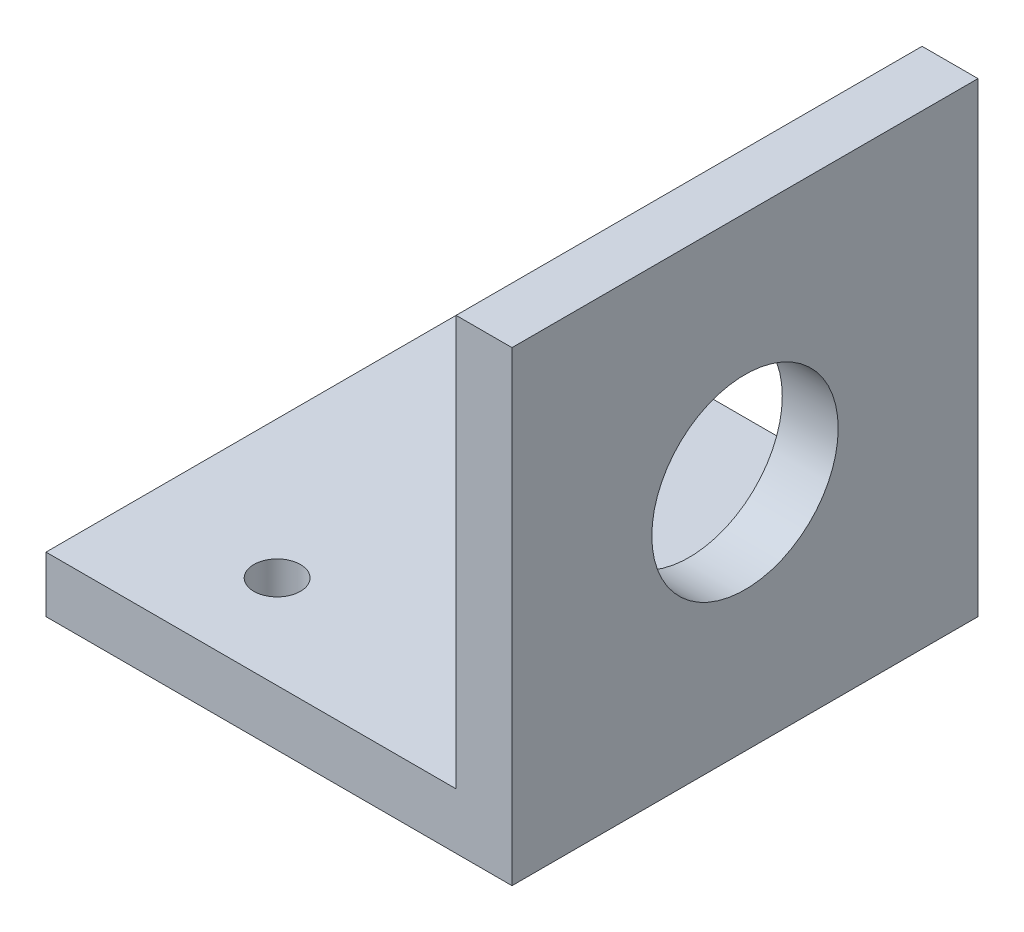
ISO-10303-21;
HEADER;
FILE_DESCRIPTION(('STEP AP214'),'2;1');
FILE_NAME('part.step','',(''),(''),'','','');
FILE_SCHEMA(('AUTOMOTIVE_DESIGN { 1 0 10303 214 1 1 1 1 }'));
ENDSEC;
DATA;
#1=APPLICATION_CONTEXT('core data for automotive mechanical design processes');
#2=APPLICATION_PROTOCOL_DEFINITION('international standard','automotive_design',2000,#1);
#3=PRODUCT_CONTEXT('',#1,'mechanical');
#4=PRODUCT('Part','Part','',(#3));
#5=PRODUCT_RELATED_PRODUCT_CATEGORY('part','',(#4));
#6=PRODUCT_DEFINITION_FORMATION('','',#4);
#7=PRODUCT_DEFINITION_CONTEXT('part definition',#1,'design');
#8=PRODUCT_DEFINITION('design','',#6,#7);
#9=PRODUCT_DEFINITION_SHAPE('','',#8);
#10=(LENGTH_UNIT() NAMED_UNIT(*) SI_UNIT(.MILLI.,.METRE.));
#11=(NAMED_UNIT(*) PLANE_ANGLE_UNIT() SI_UNIT($,.RADIAN.));
#12=(NAMED_UNIT(*) SI_UNIT($,.STERADIAN.) SOLID_ANGLE_UNIT());
#13=UNCERTAINTY_MEASURE_WITH_UNIT(LENGTH_MEASURE(1.E-05),#10,'distance_accuracy_value','');
#14=(GEOMETRIC_REPRESENTATION_CONTEXT(3) GLOBAL_UNCERTAINTY_ASSIGNED_CONTEXT((#13)) GLOBAL_UNIT_ASSIGNED_CONTEXT((#10,
#11,#12)) REPRESENTATION_CONTEXT('',''));
#15=CARTESIAN_POINT('',(0.,0.,0.));
#16=DIRECTION('',(0.,0.,1.));
#17=DIRECTION('',(1.,0.,0.));
#18=AXIS2_PLACEMENT_3D('',#15,#16,#17);
#19=CARTESIAN_POINT('',(25.,6.,-25.));
#20=DIRECTION('',(-1.,0.,0.));
#21=DIRECTION('',(0.,0.,1.));
#22=AXIS2_PLACEMENT_3D('',#19,#20,#21);
#23=PLANE('',#22);
#24=CARTESIAN_POINT('',(25.,25.,0.));
#25=DIRECTION('',(1.,0.,0.));
#26=DIRECTION('',(0.,0.,-1.));
#27=AXIS2_PLACEMENT_3D('',#24,#25,#26);
#28=CIRCLE('',#27,10.);
#29=CARTESIAN_POINT('',(25.,25.,-9.99999999999999));
#30=VERTEX_POINT('',#29);
#31=EDGE_CURVE('E145',#30,#30,#28,.T.);
#32=ORIENTED_EDGE('',*,*,#31,.F.);
#33=EDGE_LOOP('',(#32));
#34=FACE_BOUND('',#33,.T.);
#35=DIRECTION('',(0.,0.,-1.));
#36=VECTOR('',#35,1.);
#37=CARTESIAN_POINT('',(25.,0.,-25.));
#38=LINE('',#37,#36);
#39=CARTESIAN_POINT('',(25.,0.,25.));
#40=VERTEX_POINT('',#39);
#41=CARTESIAN_POINT('',(25.,0.,-25.));
#42=VERTEX_POINT('',#41);
#43=EDGE_CURVE('E93',#40,#42,#38,.T.);
#44=ORIENTED_EDGE('',*,*,#43,.T.);
#45=DIRECTION('',(0.,-1.,0.));
#46=VECTOR('',#45,1.);
#47=CARTESIAN_POINT('',(25.,6.,-25.));
#48=LINE('',#47,#46);
#49=CARTESIAN_POINT('',(25.,50.,-25.));
#50=VERTEX_POINT('',#49);
#51=EDGE_CURVE('E11',#50,#42,#48,.T.);
#52=ORIENTED_EDGE('',*,*,#51,.F.);
#53=DIRECTION('',(0.,0.,-1.));
#54=VECTOR('',#53,1.);
#55=CARTESIAN_POINT('',(25.,50.,-25.));
#56=LINE('',#55,#54);
#57=CARTESIAN_POINT('',(25.,50.,25.));
#58=VERTEX_POINT('',#57);
#59=EDGE_CURVE('E95',#58,#50,#56,.T.);
#60=ORIENTED_EDGE('',*,*,#59,.F.);
#61=DIRECTION('',(0.,-1.,0.));
#62=VECTOR('',#61,1.);
#63=CARTESIAN_POINT('',(25.,6.,25.));
#64=LINE('',#63,#62);
#65=EDGE_CURVE('E79',#58,#40,#64,.T.);
#66=ORIENTED_EDGE('',*,*,#65,.T.);
#67=EDGE_LOOP('',(#44,#52,#60,#66));
#68=FACE_BOUND('',#67,.T.);
#69=ADVANCED_FACE('F33',(#34,#68),#23,.F.);
#70=CARTESIAN_POINT('',(-25.,6.,-25.));
#71=DIRECTION('',(0.,0.,1.));
#72=DIRECTION('',(1.,0.,0.));
#73=AXIS2_PLACEMENT_3D('',#70,#71,#72);
#74=PLANE('',#73);
#75=DIRECTION('',(-1.,0.,0.));
#76=VECTOR('',#75,1.);
#77=CARTESIAN_POINT('',(-25.,0.,-25.));
#78=LINE('',#77,#76);
#79=CARTESIAN_POINT('',(-25.,0.,-25.));
#80=VERTEX_POINT('',#79);
#81=EDGE_CURVE('E99',#42,#80,#78,.T.);
#82=ORIENTED_EDGE('',*,*,#81,.T.);
#83=DIRECTION('',(0.,-1.,0.));
#84=VECTOR('',#83,1.);
#85=CARTESIAN_POINT('',(-25.,6.,-25.));
#86=LINE('',#85,#84);
#87=CARTESIAN_POINT('',(-25.,6.,-25.));
#88=VERTEX_POINT('',#87);
#89=EDGE_CURVE('E41',#88,#80,#86,.T.);
#90=ORIENTED_EDGE('',*,*,#89,.F.);
#91=DIRECTION('',(-1.,0.,0.));
#92=VECTOR('',#91,1.);
#93=CARTESIAN_POINT('',(-25.,6.,-25.));
#94=LINE('',#93,#92);
#95=CARTESIAN_POINT('',(19.,6.,-25.));
#96=VERTEX_POINT('',#95);
#97=EDGE_CURVE('E86',#96,#88,#94,.T.);
#98=ORIENTED_EDGE('',*,*,#97,.F.);
#99=DIRECTION('',(0.,-1.,0.));
#100=VECTOR('',#99,1.);
#101=CARTESIAN_POINT('',(19.,50.,-25.));
#102=LINE('',#101,#100);
#103=CARTESIAN_POINT('',(19.,50.,-25.));
#104=VERTEX_POINT('',#103);
#105=EDGE_CURVE('E100',#104,#96,#102,.T.);
#106=ORIENTED_EDGE('',*,*,#105,.F.);
#107=DIRECTION('',(-1.,0.,0.));
#108=VECTOR('',#107,1.);
#109=CARTESIAN_POINT('',(19.,50.,-25.));
#110=LINE('',#109,#108);
#111=EDGE_CURVE('E139',#50,#104,#110,.T.);
#112=ORIENTED_EDGE('',*,*,#111,.F.);
#113=ORIENTED_EDGE('',*,*,#51,.T.);
#114=EDGE_LOOP('',(#82,#90,#98,#106,#112,#113));
#115=FACE_BOUND('',#114,.T.);
#116=ADVANCED_FACE('F183',(#115),#74,.F.);
#117=CARTESIAN_POINT('',(-25.,6.,-25.));
#118=DIRECTION('',(1.,0.,0.));
#119=DIRECTION('',(0.,0.,-1.));
#120=AXIS2_PLACEMENT_3D('',#117,#118,#119);
#121=PLANE('',#120);
#122=DIRECTION('',(0.,0.,1.));
#123=VECTOR('',#122,1.);
#124=CARTESIAN_POINT('',(-25.,0.,-25.));
#125=LINE('',#124,#123);
#126=CARTESIAN_POINT('',(-25.,0.,25.));
#127=VERTEX_POINT('',#126);
#128=EDGE_CURVE('E87',#80,#127,#125,.T.);
#129=ORIENTED_EDGE('',*,*,#128,.T.);
#130=DIRECTION('',(0.,-1.,0.));
#131=VECTOR('',#130,1.);
#132=CARTESIAN_POINT('',(-25.,6.,25.));
#133=LINE('',#132,#131);
#134=CARTESIAN_POINT('',(-25.,6.,25.));
#135=VERTEX_POINT('',#134);
#136=EDGE_CURVE('E82',#135,#127,#133,.T.);
#137=ORIENTED_EDGE('',*,*,#136,.F.);
#138=DIRECTION('',(0.,0.,1.));
#139=VECTOR('',#138,1.);
#140=CARTESIAN_POINT('',(-25.,6.,-25.));
#141=LINE('',#140,#139);
#142=EDGE_CURVE('E55',#88,#135,#141,.T.);
#143=ORIENTED_EDGE('',*,*,#142,.F.);
#144=ORIENTED_EDGE('',*,*,#89,.T.);
#145=EDGE_LOOP('',(#129,#137,#143,#144));
#146=FACE_BOUND('',#145,.T.);
#147=ADVANCED_FACE('F188',(#146),#121,.F.);
#148=CARTESIAN_POINT('',(-25.,6.,25.));
#149=DIRECTION('',(0.,0.,-1.));
#150=DIRECTION('',(-1.,0.,0.));
#151=AXIS2_PLACEMENT_3D('',#148,#149,#150);
#152=PLANE('',#151);
#153=DIRECTION('',(1.,0.,0.));
#154=VECTOR('',#153,1.);
#155=CARTESIAN_POINT('',(-25.,0.,25.));
#156=LINE('',#155,#154);
#157=EDGE_CURVE('E75',#127,#40,#156,.T.);
#158=ORIENTED_EDGE('',*,*,#157,.T.);
#159=ORIENTED_EDGE('',*,*,#65,.F.);
#160=DIRECTION('',(1.,0.,0.));
#161=VECTOR('',#160,1.);
#162=CARTESIAN_POINT('',(25.,50.,25.));
#163=LINE('',#162,#161);
#164=CARTESIAN_POINT('',(19.,50.,25.));
#165=VERTEX_POINT('',#164);
#166=EDGE_CURVE('E131',#165,#58,#163,.T.);
#167=ORIENTED_EDGE('',*,*,#166,.F.);
#168=DIRECTION('',(0.,-1.,0.));
#169=VECTOR('',#168,1.);
#170=CARTESIAN_POINT('',(19.,50.,25.));
#171=LINE('',#170,#169);
#172=CARTESIAN_POINT('',(19.,6.,25.));
#173=VERTEX_POINT('',#172);
#174=EDGE_CURVE('E104',#165,#173,#171,.T.);
#175=ORIENTED_EDGE('',*,*,#174,.T.);
#176=DIRECTION('',(1.,0.,0.));
#177=VECTOR('',#176,1.);
#178=CARTESIAN_POINT('',(-25.,6.,25.));
#179=LINE('',#178,#177);
#180=EDGE_CURVE('E96',#135,#173,#179,.T.);
#181=ORIENTED_EDGE('',*,*,#180,.F.);
#182=ORIENTED_EDGE('',*,*,#136,.T.);
#183=EDGE_LOOP('',(#158,#159,#167,#175,#181,#182));
#184=FACE_BOUND('',#183,.T.);
#185=ADVANCED_FACE('F77',(#184),#152,.F.);
#186=CARTESIAN_POINT('',(0.,6.,0.));
#187=DIRECTION('',(0.,1.,0.));
#188=DIRECTION('',(0.,0.,1.));
#189=AXIS2_PLACEMENT_3D('',#186,#187,#188);
#190=PLANE('',#189);
#191=CARTESIAN_POINT('',(-10.2,6.,-15.));
#192=DIRECTION('',(0.,1.,0.));
#193=DIRECTION('',(0.,0.,1.));
#194=AXIS2_PLACEMENT_3D('',#191,#192,#193);
#195=CIRCLE('',#194,2.5);
#196=CARTESIAN_POINT('',(-10.2,6.,-12.5));
#197=VERTEX_POINT('',#196);
#198=EDGE_CURVE('E154',#197,#197,#195,.T.);
#199=ORIENTED_EDGE('',*,*,#198,.F.);
#200=EDGE_LOOP('',(#199));
#201=FACE_BOUND('',#200,.T.);
#202=CARTESIAN_POINT('',(-10.2,6.,15.));
#203=DIRECTION('',(0.,1.,0.));
#204=DIRECTION('',(0.,0.,1.));
#205=AXIS2_PLACEMENT_3D('',#202,#203,#204);
#206=CIRCLE('',#205,2.5);
#207=CARTESIAN_POINT('',(-10.2,6.,17.5));
#208=VERTEX_POINT('',#207);
#209=EDGE_CURVE('E148',#208,#208,#206,.T.);
#210=ORIENTED_EDGE('',*,*,#209,.F.);
#211=EDGE_LOOP('',(#210));
#212=FACE_BOUND('',#211,.T.);
#213=DIRECTION('',(0.,0.,1.));
#214=VECTOR('',#213,1.);
#215=CARTESIAN_POINT('',(19.,6.,25.));
#216=LINE('',#215,#214);
#217=EDGE_CURVE('E49',#96,#173,#216,.T.);
#218=ORIENTED_EDGE('',*,*,#217,.F.);
#219=ORIENTED_EDGE('',*,*,#97,.T.);
#220=ORIENTED_EDGE('',*,*,#142,.T.);
#221=ORIENTED_EDGE('',*,*,#180,.T.);
#222=EDGE_LOOP('',(#218,#219,#220,#221));
#223=FACE_BOUND('',#222,.T.);
#224=ADVANCED_FACE('F122',(#201,#212,#223),#190,.T.);
#225=CARTESIAN_POINT('',(0.,0.,0.));
#226=DIRECTION('',(0.,1.,0.));
#227=DIRECTION('',(0.,0.,1.));
#228=AXIS2_PLACEMENT_3D('',#225,#226,#227);
#229=PLANE('',#228);
#230=CARTESIAN_POINT('',(-10.2,0.,-15.));
#231=DIRECTION('',(0.,-1.,0.));
#232=DIRECTION('',(0.,0.,-1.));
#233=AXIS2_PLACEMENT_3D('',#230,#231,#232);
#234=CIRCLE('',#233,2.5);
#235=CARTESIAN_POINT('',(-10.2,0.,-17.5));
#236=VERTEX_POINT('',#235);
#237=EDGE_CURVE('E157',#236,#236,#234,.T.);
#238=ORIENTED_EDGE('',*,*,#237,.F.);
#239=EDGE_LOOP('',(#238));
#240=FACE_BOUND('',#239,.T.);
#241=CARTESIAN_POINT('',(-10.2,0.,15.));
#242=DIRECTION('',(0.,-1.,0.));
#243=DIRECTION('',(0.,0.,-1.));
#244=AXIS2_PLACEMENT_3D('',#241,#242,#243);
#245=CIRCLE('',#244,2.5);
#246=CARTESIAN_POINT('',(-10.2,0.,12.5));
#247=VERTEX_POINT('',#246);
#248=EDGE_CURVE('E151',#247,#247,#245,.T.);
#249=ORIENTED_EDGE('',*,*,#248,.F.);
#250=EDGE_LOOP('',(#249));
#251=FACE_BOUND('',#250,.T.);
#252=ORIENTED_EDGE('',*,*,#43,.F.);
#253=ORIENTED_EDGE('',*,*,#157,.F.);
#254=ORIENTED_EDGE('',*,*,#128,.F.);
#255=ORIENTED_EDGE('',*,*,#81,.F.);
#256=EDGE_LOOP('',(#252,#253,#254,#255));
#257=FACE_BOUND('',#256,.T.);
#258=ADVANCED_FACE('F98',(#240,#251,#257),#229,.F.);
#259=CARTESIAN_POINT('',(19.,50.,25.));
#260=DIRECTION('',(1.,0.,0.));
#261=DIRECTION('',(0.,0.,-1.));
#262=AXIS2_PLACEMENT_3D('',#259,#260,#261);
#263=PLANE('',#262);
#264=CARTESIAN_POINT('',(19.,25.,0.));
#265=DIRECTION('',(1.,0.,0.));
#266=DIRECTION('',(0.,0.,-1.));
#267=AXIS2_PLACEMENT_3D('',#264,#265,#266);
#268=CIRCLE('',#267,10.);
#269=CARTESIAN_POINT('',(19.,25.,-9.99999999999999));
#270=VERTEX_POINT('',#269);
#271=EDGE_CURVE('E36',#270,#270,#268,.T.);
#272=ORIENTED_EDGE('',*,*,#271,.T.);
#273=EDGE_LOOP('',(#272));
#274=FACE_BOUND('',#273,.T.);
#275=ORIENTED_EDGE('',*,*,#217,.T.);
#276=ORIENTED_EDGE('',*,*,#174,.F.);
#277=DIRECTION('',(0.,0.,1.));
#278=VECTOR('',#277,1.);
#279=CARTESIAN_POINT('',(19.,50.,25.));
#280=LINE('',#279,#278);
#281=EDGE_CURVE('E133',#104,#165,#280,.T.);
#282=ORIENTED_EDGE('',*,*,#281,.F.);
#283=ORIENTED_EDGE('',*,*,#105,.T.);
#284=EDGE_LOOP('',(#275,#276,#282,#283));
#285=FACE_BOUND('',#284,.T.);
#286=ADVANCED_FACE('F127',(#274,#285),#263,.F.);
#287=CARTESIAN_POINT('',(0.,50.,0.));
#288=DIRECTION('',(0.,-1.,0.));
#289=DIRECTION('',(0.,0.,-1.));
#290=AXIS2_PLACEMENT_3D('',#287,#288,#289);
#291=PLANE('',#290);
#292=ORIENTED_EDGE('',*,*,#59,.T.);
#293=ORIENTED_EDGE('',*,*,#111,.T.);
#294=ORIENTED_EDGE('',*,*,#281,.T.);
#295=ORIENTED_EDGE('',*,*,#166,.T.);
#296=EDGE_LOOP('',(#292,#293,#294,#295));
#297=FACE_BOUND('',#296,.T.);
#298=ADVANCED_FACE('F179',(#297),#291,.F.);
#299=CARTESIAN_POINT('',(-19.,25.,0.));
#300=DIRECTION('',(1.,0.,0.));
#301=DIRECTION('',(0.,0.,-1.));
#302=AXIS2_PLACEMENT_3D('',#299,#300,#301);
#303=CYLINDRICAL_SURFACE('',#302,10.);
#304=ORIENTED_EDGE('',*,*,#31,.T.);
#305=EDGE_LOOP('',(#304));
#306=FACE_BOUND('',#305,.T.);
#307=ORIENTED_EDGE('',*,*,#271,.F.);
#308=EDGE_LOOP('',(#307));
#309=FACE_BOUND('',#308,.T.);
#310=ADVANCED_FACE('F170',(#306,#309),#303,.F.);
#311=CARTESIAN_POINT('',(-10.2,44.,15.));
#312=DIRECTION('',(0.,-1.,0.));
#313=DIRECTION('',(0.,0.,-1.));
#314=AXIS2_PLACEMENT_3D('',#311,#312,#313);
#315=CYLINDRICAL_SURFACE('',#314,2.5);
#316=ORIENTED_EDGE('',*,*,#209,.T.);
#317=EDGE_LOOP('',(#316));
#318=FACE_BOUND('',#317,.T.);
#319=ORIENTED_EDGE('',*,*,#248,.T.);
#320=EDGE_LOOP('',(#319));
#321=FACE_BOUND('',#320,.T.);
#322=ADVANCED_FACE('F168',(#318,#321),#315,.F.);
#323=CARTESIAN_POINT('',(-10.2,44.,-15.));
#324=DIRECTION('',(0.,-1.,0.));
#325=DIRECTION('',(0.,0.,-1.));
#326=AXIS2_PLACEMENT_3D('',#323,#324,#325);
#327=CYLINDRICAL_SURFACE('',#326,2.5);
#328=ORIENTED_EDGE('',*,*,#198,.T.);
#329=EDGE_LOOP('',(#328));
#330=FACE_BOUND('',#329,.T.);
#331=ORIENTED_EDGE('',*,*,#237,.T.);
#332=EDGE_LOOP('',(#331));
#333=FACE_BOUND('',#332,.T.);
#334=ADVANCED_FACE('F161',(#330,#333),#327,.F.);
#335=CLOSED_SHELL('',(#69,#116,#147,#185,#224,#258,#286,#298,#310,#322,#334));
#336=MANIFOLD_SOLID_BREP('B2',#335);
#337=ADVANCED_BREP_SHAPE_REPRESENTATION('',(#18,#336),#14);
#338=SHAPE_DEFINITION_REPRESENTATION(#9,#337);
ENDSEC;
END-ISO-10303-21;
